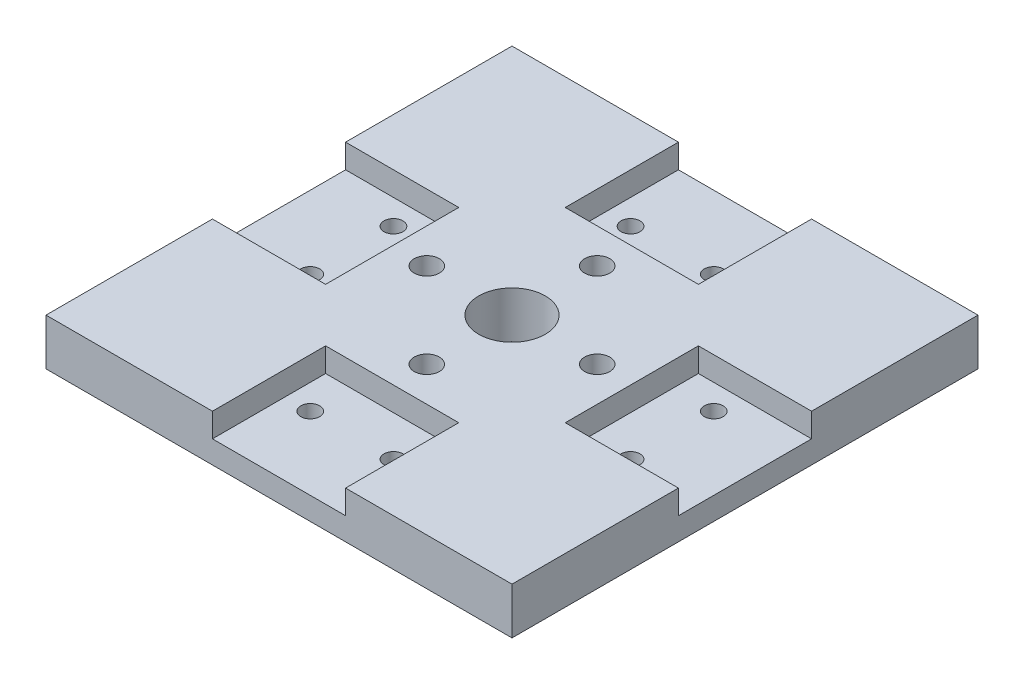
ISO-10303-21;
HEADER;
FILE_DESCRIPTION(('STEP AP214'),'2;1');
FILE_NAME('part.step','',(''),(''),'','','');
FILE_SCHEMA(('AUTOMOTIVE_DESIGN { 1 0 10303 214 1 1 1 1 }'));
ENDSEC;
DATA;
#1=APPLICATION_CONTEXT('core data for automotive mechanical design processes');
#2=APPLICATION_PROTOCOL_DEFINITION('international standard','automotive_design',2000,#1);
#3=PRODUCT_CONTEXT('',#1,'mechanical');
#4=PRODUCT('Part','Part','',(#3));
#5=PRODUCT_RELATED_PRODUCT_CATEGORY('part','',(#4));
#6=PRODUCT_DEFINITION_FORMATION('','',#4);
#7=PRODUCT_DEFINITION_CONTEXT('part definition',#1,'design');
#8=PRODUCT_DEFINITION('design','',#6,#7);
#9=PRODUCT_DEFINITION_SHAPE('','',#8);
#10=(LENGTH_UNIT() NAMED_UNIT(*) SI_UNIT(.MILLI.,.METRE.));
#11=(NAMED_UNIT(*) PLANE_ANGLE_UNIT() SI_UNIT($,.RADIAN.));
#12=(NAMED_UNIT(*) SI_UNIT($,.STERADIAN.) SOLID_ANGLE_UNIT());
#13=UNCERTAINTY_MEASURE_WITH_UNIT(LENGTH_MEASURE(1.E-05),#10,'distance_accuracy_value','');
#14=(GEOMETRIC_REPRESENTATION_CONTEXT(3) GLOBAL_UNCERTAINTY_ASSIGNED_CONTEXT((#13)) GLOBAL_UNIT_ASSIGNED_CONTEXT((#10,
#11,#12)) REPRESENTATION_CONTEXT('',''));
#15=CARTESIAN_POINT('',(0.,0.,0.));
#16=DIRECTION('',(0.,0.,1.));
#17=DIRECTION('',(1.,0.,0.));
#18=AXIS2_PLACEMENT_3D('',#15,#16,#17);
#19=CARTESIAN_POINT('',(0.,8.89,0.));
#20=DIRECTION('',(1.,0.,0.));
#21=DIRECTION('',(0.,0.,-1.));
#22=AXIS2_PLACEMENT_3D('',#19,#20,#21);
#23=PLANE('',#22);
#24=DIRECTION('',(0.,0.,1.));
#25=VECTOR('',#24,1.);
#26=CARTESIAN_POINT('',(0.,4.318,-57.15));
#27=LINE('',#26,#25);
#28=CARTESIAN_POINT('',(0.,4.318,-57.15));
#29=VERTEX_POINT('',#28);
#30=CARTESIAN_POINT('',(0.,4.318,-31.75));
#31=VERTEX_POINT('',#30);
#32=EDGE_CURVE('E232',#29,#31,#27,.T.);
#33=ORIENTED_EDGE('',*,*,#32,.F.);
#34=DIRECTION('',(0.,1.,0.));
#35=VECTOR('',#34,1.);
#36=CARTESIAN_POINT('',(0.,4.318,-57.15));
#37=LINE('',#36,#35);
#38=CARTESIAN_POINT('',(0.,8.89,-57.15));
#39=VERTEX_POINT('',#38);
#40=EDGE_CURVE('E225',#29,#39,#37,.T.);
#41=ORIENTED_EDGE('',*,*,#40,.T.);
#42=DIRECTION('',(0.,0.,1.));
#43=VECTOR('',#42,1.);
#44=CARTESIAN_POINT('',(0.,8.89,0.));
#45=LINE('',#44,#43);
#46=CARTESIAN_POINT('',(0.,8.89,-88.9));
#47=VERTEX_POINT('',#46);
#48=EDGE_CURVE('E303',#47,#39,#45,.T.);
#49=ORIENTED_EDGE('',*,*,#48,.F.);
#50=DIRECTION('',(0.,-1.,0.));
#51=VECTOR('',#50,1.);
#52=CARTESIAN_POINT('',(0.,8.89,-88.9));
#53=LINE('',#52,#51);
#54=CARTESIAN_POINT('',(0.,0.,-88.9));
#55=VERTEX_POINT('',#54);
#56=EDGE_CURVE('E319',#47,#55,#53,.T.);
#57=ORIENTED_EDGE('',*,*,#56,.T.);
#58=DIRECTION('',(0.,0.,1.));
#59=VECTOR('',#58,1.);
#60=CARTESIAN_POINT('',(0.,0.,0.));
#61=LINE('',#60,#59);
#62=CARTESIAN_POINT('',(0.,0.,0.));
#63=VERTEX_POINT('',#62);
#64=EDGE_CURVE('E213',#55,#63,#61,.T.);
#65=ORIENTED_EDGE('',*,*,#64,.T.);
#66=DIRECTION('',(0.,-1.,0.));
#67=VECTOR('',#66,1.);
#68=CARTESIAN_POINT('',(0.,8.89,0.));
#69=LINE('',#68,#67);
#70=CARTESIAN_POINT('',(0.,8.89,0.));
#71=VERTEX_POINT('',#70);
#72=EDGE_CURVE('E11',#71,#63,#69,.T.);
#73=ORIENTED_EDGE('',*,*,#72,.F.);
#74=CARTESIAN_POINT('',(0.,8.89,-31.75));
#75=VERTEX_POINT('',#74);
#76=EDGE_CURVE('E307',#75,#71,#45,.T.);
#77=ORIENTED_EDGE('',*,*,#76,.F.);
#78=DIRECTION('',(0.,1.,0.));
#79=VECTOR('',#78,1.);
#80=CARTESIAN_POINT('',(0.,4.318,-31.75));
#81=LINE('',#80,#79);
#82=EDGE_CURVE('E218',#31,#75,#81,.T.);
#83=ORIENTED_EDGE('',*,*,#82,.F.);
#84=EDGE_LOOP('',(#33,#41,#49,#57,#65,#73,#77,#83));
#85=FACE_BOUND('',#84,.T.);
#86=ADVANCED_FACE('F41',(#85),#23,.F.);
#87=CARTESIAN_POINT('',(0.,8.89,0.));
#88=DIRECTION('',(0.,0.,-1.));
#89=DIRECTION('',(-1.,0.,0.));
#90=AXIS2_PLACEMENT_3D('',#87,#88,#89);
#91=PLANE('',#90);
#92=DIRECTION('',(1.,0.,0.));
#93=VECTOR('',#92,1.);
#94=CARTESIAN_POINT('',(31.75,4.318,0.));
#95=LINE('',#94,#93);
#96=CARTESIAN_POINT('',(31.75,4.318,0.));
#97=VERTEX_POINT('',#96);
#98=CARTESIAN_POINT('',(57.15,4.318,0.));
#99=VERTEX_POINT('',#98);
#100=EDGE_CURVE('E271',#97,#99,#95,.T.);
#101=ORIENTED_EDGE('',*,*,#100,.F.);
#102=DIRECTION('',(0.,1.,0.));
#103=VECTOR('',#102,1.);
#104=CARTESIAN_POINT('',(31.75,4.318,0.));
#105=LINE('',#104,#103);
#106=CARTESIAN_POINT('',(31.75,8.89,0.));
#107=VERTEX_POINT('',#106);
#108=EDGE_CURVE('E247',#97,#107,#105,.T.);
#109=ORIENTED_EDGE('',*,*,#108,.T.);
#110=DIRECTION('',(1.,0.,0.));
#111=VECTOR('',#110,1.);
#112=CARTESIAN_POINT('',(0.,8.89,0.));
#113=LINE('',#112,#111);
#114=EDGE_CURVE('E308',#71,#107,#113,.T.);
#115=ORIENTED_EDGE('',*,*,#114,.F.);
#116=ORIENTED_EDGE('',*,*,#72,.T.);
#117=DIRECTION('',(1.,0.,0.));
#118=VECTOR('',#117,1.);
#119=CARTESIAN_POINT('',(0.,0.,0.));
#120=LINE('',#119,#118);
#121=CARTESIAN_POINT('',(88.9,0.,0.));
#122=VERTEX_POINT('',#121);
#123=EDGE_CURVE('E322',#63,#122,#120,.T.);
#124=ORIENTED_EDGE('',*,*,#123,.T.);
#125=DIRECTION('',(0.,-1.,0.));
#126=VECTOR('',#125,1.);
#127=CARTESIAN_POINT('',(88.9,8.89,0.));
#128=LINE('',#127,#126);
#129=CARTESIAN_POINT('',(88.9,8.89,0.));
#130=VERTEX_POINT('',#129);
#131=EDGE_CURVE('E48',#130,#122,#128,.T.);
#132=ORIENTED_EDGE('',*,*,#131,.F.);
#133=CARTESIAN_POINT('',(57.15,8.89,0.));
#134=VERTEX_POINT('',#133);
#135=EDGE_CURVE('E306',#134,#130,#113,.T.);
#136=ORIENTED_EDGE('',*,*,#135,.F.);
#137=DIRECTION('',(0.,1.,0.));
#138=VECTOR('',#137,1.);
#139=CARTESIAN_POINT('',(57.15,4.318,0.));
#140=LINE('',#139,#138);
#141=EDGE_CURVE('E251',#99,#134,#140,.T.);
#142=ORIENTED_EDGE('',*,*,#141,.F.);
#143=EDGE_LOOP('',(#101,#109,#115,#116,#124,#132,#136,#142));
#144=FACE_BOUND('',#143,.T.);
#145=ADVANCED_FACE('F374',(#144),#91,.F.);
#146=CARTESIAN_POINT('',(88.9,8.89,0.));
#147=DIRECTION('',(-1.,0.,0.));
#148=DIRECTION('',(0.,0.,1.));
#149=AXIS2_PLACEMENT_3D('',#146,#147,#148);
#150=PLANE('',#149);
#151=DIRECTION('',(0.,0.,-1.));
#152=VECTOR('',#151,1.);
#153=CARTESIAN_POINT('',(88.9,4.318,-57.15));
#154=LINE('',#153,#152);
#155=CARTESIAN_POINT('',(88.9,4.318,-31.75));
#156=VERTEX_POINT('',#155);
#157=CARTESIAN_POINT('',(88.9,4.318,-57.15));
#158=VERTEX_POINT('',#157);
#159=EDGE_CURVE('E289',#156,#158,#154,.T.);
#160=ORIENTED_EDGE('',*,*,#159,.F.);
#161=DIRECTION('',(0.,1.,0.));
#162=VECTOR('',#161,1.);
#163=CARTESIAN_POINT('',(88.9,4.318,-31.75));
#164=LINE('',#163,#162);
#165=CARTESIAN_POINT('',(88.9,8.89,-31.75));
#166=VERTEX_POINT('',#165);
#167=EDGE_CURVE('E282',#156,#166,#164,.T.);
#168=ORIENTED_EDGE('',*,*,#167,.T.);
#169=DIRECTION('',(0.,0.,-1.));
#170=VECTOR('',#169,1.);
#171=CARTESIAN_POINT('',(88.9,8.89,0.));
#172=LINE('',#171,#170);
#173=EDGE_CURVE('E312',#130,#166,#172,.T.);
#174=ORIENTED_EDGE('',*,*,#173,.F.);
#175=ORIENTED_EDGE('',*,*,#131,.T.);
#176=DIRECTION('',(0.,0.,-1.));
#177=VECTOR('',#176,1.);
#178=CARTESIAN_POINT('',(88.9,0.,0.));
#179=LINE('',#178,#177);
#180=CARTESIAN_POINT('',(88.9,0.,-88.9));
#181=VERTEX_POINT('',#180);
#182=EDGE_CURVE('E324',#122,#181,#179,.T.);
#183=ORIENTED_EDGE('',*,*,#182,.T.);
#184=DIRECTION('',(0.,-1.,0.));
#185=VECTOR('',#184,1.);
#186=CARTESIAN_POINT('',(88.9,8.89,-88.9));
#187=LINE('',#186,#185);
#188=CARTESIAN_POINT('',(88.9,8.89,-88.9));
#189=VERTEX_POINT('',#188);
#190=EDGE_CURVE('E330',#189,#181,#187,.T.);
#191=ORIENTED_EDGE('',*,*,#190,.F.);
#192=CARTESIAN_POINT('',(88.9,8.89,-57.15));
#193=VERTEX_POINT('',#192);
#194=EDGE_CURVE('E311',#193,#189,#172,.T.);
#195=ORIENTED_EDGE('',*,*,#194,.F.);
#196=DIRECTION('',(0.,1.,0.));
#197=VECTOR('',#196,1.);
#198=CARTESIAN_POINT('',(88.9,4.318,-57.15));
#199=LINE('',#198,#197);
#200=EDGE_CURVE('E63',#158,#193,#199,.T.);
#201=ORIENTED_EDGE('',*,*,#200,.F.);
#202=EDGE_LOOP('',(#160,#168,#174,#175,#183,#191,#195,#201));
#203=FACE_BOUND('',#202,.T.);
#204=ADVANCED_FACE('F338',(#203),#150,.F.);
#205=CARTESIAN_POINT('',(0.,8.89,-88.9));
#206=DIRECTION('',(0.,0.,1.));
#207=DIRECTION('',(1.,0.,0.));
#208=AXIS2_PLACEMENT_3D('',#205,#206,#207);
#209=PLANE('',#208);
#210=DIRECTION('',(-1.,0.,0.));
#211=VECTOR('',#210,1.);
#212=CARTESIAN_POINT('',(0.,8.89,-88.9));
#213=LINE('',#212,#211);
#214=CARTESIAN_POINT('',(31.75,8.89,-88.9));
#215=VERTEX_POINT('',#214);
#216=EDGE_CURVE('E315',#215,#47,#213,.T.);
#217=ORIENTED_EDGE('',*,*,#216,.F.);
#218=DIRECTION('',(0.,1.,0.));
#219=VECTOR('',#218,1.);
#220=CARTESIAN_POINT('',(31.75,4.318,-88.9));
#221=LINE('',#220,#219);
#222=CARTESIAN_POINT('',(31.75,4.318,-88.9));
#223=VERTEX_POINT('',#222);
#224=EDGE_CURVE('E211',#223,#215,#221,.T.);
#225=ORIENTED_EDGE('',*,*,#224,.F.);
#226=DIRECTION('',(-1.,0.,0.));
#227=VECTOR('',#226,1.);
#228=CARTESIAN_POINT('',(31.75,4.318,-88.9));
#229=LINE('',#228,#227);
#230=CARTESIAN_POINT('',(57.15,4.318,-88.9));
#231=VERTEX_POINT('',#230);
#232=EDGE_CURVE('E185',#231,#223,#229,.T.);
#233=ORIENTED_EDGE('',*,*,#232,.F.);
#234=DIRECTION('',(0.,1.,0.));
#235=VECTOR('',#234,1.);
#236=CARTESIAN_POINT('',(57.15,4.318,-88.9));
#237=LINE('',#236,#235);
#238=CARTESIAN_POINT('',(57.15,8.89,-88.9));
#239=VERTEX_POINT('',#238);
#240=EDGE_CURVE('E214',#231,#239,#237,.T.);
#241=ORIENTED_EDGE('',*,*,#240,.T.);
#242=EDGE_CURVE('E316',#189,#239,#213,.T.);
#243=ORIENTED_EDGE('',*,*,#242,.F.);
#244=ORIENTED_EDGE('',*,*,#190,.T.);
#245=DIRECTION('',(-1.,0.,0.));
#246=VECTOR('',#245,1.);
#247=CARTESIAN_POINT('',(0.,0.,-88.9));
#248=LINE('',#247,#246);
#249=EDGE_CURVE('E326',#181,#55,#248,.T.);
#250=ORIENTED_EDGE('',*,*,#249,.T.);
#251=ORIENTED_EDGE('',*,*,#56,.F.);
#252=EDGE_LOOP('',(#217,#225,#233,#241,#243,#244,#250,#251));
#253=FACE_BOUND('',#252,.T.);
#254=ADVANCED_FACE('F349',(#253),#209,.F.);
#255=CARTESIAN_POINT('',(0.,8.89,0.));
#256=DIRECTION('',(0.,-1.,0.));
#257=DIRECTION('',(0.,0.,-1.));
#258=AXIS2_PLACEMENT_3D('',#255,#256,#257);
#259=PLANE('',#258);
#260=CARTESIAN_POINT('',(44.45,8.89,-44.45));
#261=DIRECTION('',(0.,1.,0.));
#262=DIRECTION('',(0.,0.,1.));
#263=AXIS2_PLACEMENT_3D('',#260,#261,#262);
#264=CIRCLE('',#263,6.35);
#265=CARTESIAN_POINT('',(44.45,8.89,-38.1));
#266=VERTEX_POINT('',#265);
#267=EDGE_CURVE('E470',#266,#266,#264,.T.);
#268=ORIENTED_EDGE('',*,*,#267,.F.);
#269=EDGE_LOOP('',(#268));
#270=FACE_BOUND('',#269,.T.);
#271=CARTESIAN_POINT('',(60.706,8.89,-44.45));
#272=DIRECTION('',(0.,1.,0.));
#273=DIRECTION('',(0.,0.,1.));
#274=AXIS2_PLACEMENT_3D('',#271,#272,#273);
#275=CIRCLE('',#274,2.40000002599999);
#276=CARTESIAN_POINT('',(60.706,8.89,-42.049999974));
#277=VERTEX_POINT('',#276);
#278=EDGE_CURVE('E512',#277,#277,#275,.T.);
#279=ORIENTED_EDGE('',*,*,#278,.F.);
#280=EDGE_LOOP('',(#279));
#281=FACE_BOUND('',#280,.T.);
#282=CARTESIAN_POINT('',(44.45,8.89,-60.706));
#283=DIRECTION('',(0.,1.,0.));
#284=DIRECTION('',(0.,0.,1.));
#285=AXIS2_PLACEMENT_3D('',#282,#283,#284);
#286=CIRCLE('',#285,2.400000026);
#287=CARTESIAN_POINT('',(44.45,8.89,-58.305999974));
#288=VERTEX_POINT('',#287);
#289=EDGE_CURVE('E515',#288,#288,#286,.T.);
#290=ORIENTED_EDGE('',*,*,#289,.F.);
#291=EDGE_LOOP('',(#290));
#292=FACE_BOUND('',#291,.T.);
#293=CARTESIAN_POINT('',(28.194,8.89,-44.45));
#294=DIRECTION('',(0.,1.,0.));
#295=DIRECTION('',(0.,0.,1.));
#296=AXIS2_PLACEMENT_3D('',#293,#294,#295);
#297=CIRCLE('',#296,2.400000026);
#298=CARTESIAN_POINT('',(28.194,8.89,-42.049999974));
#299=VERTEX_POINT('',#298);
#300=EDGE_CURVE('E521',#299,#299,#297,.T.);
#301=ORIENTED_EDGE('',*,*,#300,.F.);
#302=EDGE_LOOP('',(#301));
#303=FACE_BOUND('',#302,.T.);
#304=CARTESIAN_POINT('',(44.45,8.89,-28.194));
#305=DIRECTION('',(0.,1.,0.));
#306=DIRECTION('',(0.,0.,1.));
#307=AXIS2_PLACEMENT_3D('',#304,#305,#306);
#308=CIRCLE('',#307,2.40000002600001);
#309=CARTESIAN_POINT('',(44.45,8.89,-25.793999974));
#310=VERTEX_POINT('',#309);
#311=EDGE_CURVE('E526',#310,#310,#308,.T.);
#312=ORIENTED_EDGE('',*,*,#311,.F.);
#313=EDGE_LOOP('',(#312));
#314=FACE_BOUND('',#313,.T.);
#315=DIRECTION('',(1.,0.,0.));
#316=VECTOR('',#315,1.);
#317=CARTESIAN_POINT('',(31.75,8.89,-67.31));
#318=LINE('',#317,#316);
#319=CARTESIAN_POINT('',(31.75,8.89,-67.31));
#320=VERTEX_POINT('',#319);
#321=CARTESIAN_POINT('',(57.15,8.89,-67.31));
#322=VERTEX_POINT('',#321);
#323=EDGE_CURVE('E200',#320,#322,#318,.T.);
#324=ORIENTED_EDGE('',*,*,#323,.F.);
#325=DIRECTION('',(0.,0.,1.));
#326=VECTOR('',#325,1.);
#327=CARTESIAN_POINT('',(31.75,8.89,-88.9));
#328=LINE('',#327,#326);
#329=EDGE_CURVE('E55',#215,#320,#328,.T.);
#330=ORIENTED_EDGE('',*,*,#329,.F.);
#331=ORIENTED_EDGE('',*,*,#216,.T.);
#332=ORIENTED_EDGE('',*,*,#48,.T.);
#333=DIRECTION('',(-1.,0.,0.));
#334=VECTOR('',#333,1.);
#335=CARTESIAN_POINT('',(0.,8.89,-57.15));
#336=LINE('',#335,#334);
#337=CARTESIAN_POINT('',(21.59,8.89,-57.15));
#338=VERTEX_POINT('',#337);
#339=EDGE_CURVE('E229',#338,#39,#336,.T.);
#340=ORIENTED_EDGE('',*,*,#339,.F.);
#341=DIRECTION('',(0.,0.,-1.));
#342=VECTOR('',#341,1.);
#343=CARTESIAN_POINT('',(21.59,8.89,-57.15));
#344=LINE('',#343,#342);
#345=CARTESIAN_POINT('',(21.59,8.89,-31.75));
#346=VERTEX_POINT('',#345);
#347=EDGE_CURVE('E231',#346,#338,#344,.T.);
#348=ORIENTED_EDGE('',*,*,#347,.F.);
#349=DIRECTION('',(1.,0.,0.));
#350=VECTOR('',#349,1.);
#351=CARTESIAN_POINT('',(0.,8.89,-31.75));
#352=LINE('',#351,#350);
#353=EDGE_CURVE('E209',#75,#346,#352,.T.);
#354=ORIENTED_EDGE('',*,*,#353,.F.);
#355=ORIENTED_EDGE('',*,*,#76,.T.);
#356=ORIENTED_EDGE('',*,*,#114,.T.);
#357=DIRECTION('',(0.,0.,1.));
#358=VECTOR('',#357,1.);
#359=CARTESIAN_POINT('',(31.75,8.89,0.));
#360=LINE('',#359,#358);
#361=CARTESIAN_POINT('',(31.75,8.89,-21.59));
#362=VERTEX_POINT('',#361);
#363=EDGE_CURVE('E228',#362,#107,#360,.T.);
#364=ORIENTED_EDGE('',*,*,#363,.F.);
#365=DIRECTION('',(-1.,0.,0.));
#366=VECTOR('',#365,1.);
#367=CARTESIAN_POINT('',(31.75,8.89,-21.59));
#368=LINE('',#367,#366);
#369=CARTESIAN_POINT('',(57.15,8.89,-21.59));
#370=VERTEX_POINT('',#369);
#371=EDGE_CURVE('E258',#370,#362,#368,.T.);
#372=ORIENTED_EDGE('',*,*,#371,.F.);
#373=DIRECTION('',(0.,0.,-1.));
#374=VECTOR('',#373,1.);
#375=CARTESIAN_POINT('',(57.15,8.89,0.));
#376=LINE('',#375,#374);
#377=EDGE_CURVE('E261',#134,#370,#376,.T.);
#378=ORIENTED_EDGE('',*,*,#377,.F.);
#379=ORIENTED_EDGE('',*,*,#135,.T.);
#380=ORIENTED_EDGE('',*,*,#173,.T.);
#381=DIRECTION('',(1.,0.,0.));
#382=VECTOR('',#381,1.);
#383=CARTESIAN_POINT('',(88.9,8.89,-31.75));
#384=LINE('',#383,#382);
#385=CARTESIAN_POINT('',(67.31,8.89,-31.75));
#386=VERTEX_POINT('',#385);
#387=EDGE_CURVE('E286',#386,#166,#384,.T.);
#388=ORIENTED_EDGE('',*,*,#387,.F.);
#389=DIRECTION('',(0.,0.,1.));
#390=VECTOR('',#389,1.);
#391=CARTESIAN_POINT('',(67.31,8.89,-57.15));
#392=LINE('',#391,#390);
#393=CARTESIAN_POINT('',(67.31,8.89,-57.15));
#394=VERTEX_POINT('',#393);
#395=EDGE_CURVE('E288',#394,#386,#392,.T.);
#396=ORIENTED_EDGE('',*,*,#395,.F.);
#397=DIRECTION('',(-1.,0.,0.));
#398=VECTOR('',#397,1.);
#399=CARTESIAN_POINT('',(88.9,8.89,-57.15));
#400=LINE('',#399,#398);
#401=EDGE_CURVE('E257',#193,#394,#400,.T.);
#402=ORIENTED_EDGE('',*,*,#401,.F.);
#403=ORIENTED_EDGE('',*,*,#194,.T.);
#404=ORIENTED_EDGE('',*,*,#242,.T.);
#405=DIRECTION('',(0.,0.,-1.));
#406=VECTOR('',#405,1.);
#407=CARTESIAN_POINT('',(57.15,8.89,-88.9));
#408=LINE('',#407,#406);
#409=EDGE_CURVE('E198',#322,#239,#408,.T.);
#410=ORIENTED_EDGE('',*,*,#409,.F.);
#411=EDGE_LOOP('',(#324,#330,#331,#332,#340,#348,#354,#355,#356,#364,#372,#378,#379,#380,#388,
#396,#402,#403,#404,#410));
#412=FACE_BOUND('',#411,.T.);
#413=ADVANCED_FACE('F357',(#270,#281,#292,#303,#314,#412),#259,.F.);
#414=CARTESIAN_POINT('',(0.,0.,0.));
#415=DIRECTION('',(0.,-1.,0.));
#416=DIRECTION('',(0.,0.,-1.));
#417=AXIS2_PLACEMENT_3D('',#414,#415,#416);
#418=PLANE('',#417);
#419=CARTESIAN_POINT('',(44.45,0.,-44.45));
#420=DIRECTION('',(0.,1.,0.));
#421=DIRECTION('',(0.,0.,1.));
#422=AXIS2_PLACEMENT_3D('',#419,#420,#421);
#423=CIRCLE('',#422,6.35);
#424=CARTESIAN_POINT('',(44.45,0.,-38.1));
#425=VERTEX_POINT('',#424);
#426=EDGE_CURVE('E484',#425,#425,#423,.T.);
#427=ORIENTED_EDGE('',*,*,#426,.T.);
#428=EDGE_LOOP('',(#427));
#429=FACE_BOUND('',#428,.T.);
#430=CARTESIAN_POINT('',(75.0062,0.,-36.5125));
#431=DIRECTION('',(0.,1.,0.));
#432=DIRECTION('',(0.,0.,1.));
#433=AXIS2_PLACEMENT_3D('',#430,#431,#432);
#434=CIRCLE('',#433,1.8034);
#435=CARTESIAN_POINT('',(75.0062,0.,-34.7091));
#436=VERTEX_POINT('',#435);
#437=EDGE_CURVE('E489',#436,#436,#434,.T.);
#438=ORIENTED_EDGE('',*,*,#437,.T.);
#439=EDGE_LOOP('',(#438));
#440=FACE_BOUND('',#439,.T.);
#441=CARTESIAN_POINT('',(52.3875,0.,-75.0062));
#442=DIRECTION('',(0.,1.,0.));
#443=DIRECTION('',(0.,0.,1.));
#444=AXIS2_PLACEMENT_3D('',#441,#442,#443);
#445=CIRCLE('',#444,1.80339999999999);
#446=CARTESIAN_POINT('',(52.3875,0.,-73.2028));
#447=VERTEX_POINT('',#446);
#448=EDGE_CURVE('E495',#447,#447,#445,.T.);
#449=ORIENTED_EDGE('',*,*,#448,.T.);
#450=EDGE_LOOP('',(#449));
#451=FACE_BOUND('',#450,.T.);
#452=CARTESIAN_POINT('',(36.5125,0.,-75.0062));
#453=DIRECTION('',(0.,1.,0.));
#454=DIRECTION('',(0.,0.,1.));
#455=AXIS2_PLACEMENT_3D('',#452,#453,#454);
#456=CIRCLE('',#455,1.80339999999999);
#457=CARTESIAN_POINT('',(36.5125,0.,-73.2028));
#458=VERTEX_POINT('',#457);
#459=EDGE_CURVE('E501',#458,#458,#456,.T.);
#460=ORIENTED_EDGE('',*,*,#459,.T.);
#461=EDGE_LOOP('',(#460));
#462=FACE_BOUND('',#461,.T.);
#463=CARTESIAN_POINT('',(13.8938,0.,-52.3875));
#464=DIRECTION('',(0.,1.,0.));
#465=DIRECTION('',(0.,0.,1.));
#466=AXIS2_PLACEMENT_3D('',#463,#464,#465);
#467=CIRCLE('',#466,1.8034);
#468=CARTESIAN_POINT('',(13.8938,0.,-50.5841));
#469=VERTEX_POINT('',#468);
#470=EDGE_CURVE('E461',#469,#469,#467,.T.);
#471=ORIENTED_EDGE('',*,*,#470,.T.);
#472=EDGE_LOOP('',(#471));
#473=FACE_BOUND('',#472,.T.);
#474=CARTESIAN_POINT('',(13.8938,0.,-36.5125));
#475=DIRECTION('',(0.,1.,0.));
#476=DIRECTION('',(0.,0.,1.));
#477=AXIS2_PLACEMENT_3D('',#474,#475,#476);
#478=CIRCLE('',#477,1.8034);
#479=CARTESIAN_POINT('',(13.8938,0.,-34.7091));
#480=VERTEX_POINT('',#479);
#481=EDGE_CURVE('E462',#480,#480,#478,.T.);
#482=ORIENTED_EDGE('',*,*,#481,.T.);
#483=EDGE_LOOP('',(#482));
#484=FACE_BOUND('',#483,.T.);
#485=CARTESIAN_POINT('',(36.5125,0.,-13.8938));
#486=DIRECTION('',(0.,1.,0.));
#487=DIRECTION('',(0.,0.,1.));
#488=AXIS2_PLACEMENT_3D('',#485,#486,#487);
#489=CIRCLE('',#488,1.8034);
#490=CARTESIAN_POINT('',(36.5125,0.,-12.0904));
#491=VERTEX_POINT('',#490);
#492=EDGE_CURVE('E475',#491,#491,#489,.T.);
#493=ORIENTED_EDGE('',*,*,#492,.T.);
#494=EDGE_LOOP('',(#493));
#495=FACE_BOUND('',#494,.T.);
#496=CARTESIAN_POINT('',(52.3875,0.,-13.8938));
#497=DIRECTION('',(0.,1.,0.));
#498=DIRECTION('',(0.,0.,1.));
#499=AXIS2_PLACEMENT_3D('',#496,#497,#498);
#500=CIRCLE('',#499,1.8034);
#501=CARTESIAN_POINT('',(52.3875,0.,-12.0904));
#502=VERTEX_POINT('',#501);
#503=EDGE_CURVE('E481',#502,#502,#500,.T.);
#504=ORIENTED_EDGE('',*,*,#503,.T.);
#505=EDGE_LOOP('',(#504));
#506=FACE_BOUND('',#505,.T.);
#507=CARTESIAN_POINT('',(75.0062,0.,-52.3875));
#508=DIRECTION('',(0.,1.,0.));
#509=DIRECTION('',(0.,0.,1.));
#510=AXIS2_PLACEMENT_3D('',#507,#508,#509);
#511=CIRCLE('',#510,1.8034);
#512=CARTESIAN_POINT('',(75.0062,0.,-50.5841));
#513=VERTEX_POINT('',#512);
#514=EDGE_CURVE('E505',#513,#513,#511,.T.);
#515=ORIENTED_EDGE('',*,*,#514,.T.);
#516=EDGE_LOOP('',(#515));
#517=FACE_BOUND('',#516,.T.);
#518=CARTESIAN_POINT('',(60.706,0.,-44.45));
#519=DIRECTION('',(0.,1.,0.));
#520=DIRECTION('',(0.,0.,1.));
#521=AXIS2_PLACEMENT_3D('',#518,#519,#520);
#522=CIRCLE('',#521,2.40000002599999);
#523=CARTESIAN_POINT('',(60.706,0.,-42.049999974));
#524=VERTEX_POINT('',#523);
#525=EDGE_CURVE('E285',#524,#524,#522,.T.);
#526=ORIENTED_EDGE('',*,*,#525,.T.);
#527=EDGE_LOOP('',(#526));
#528=FACE_BOUND('',#527,.T.);
#529=CARTESIAN_POINT('',(44.45,0.,-60.706));
#530=DIRECTION('',(0.,1.,0.));
#531=DIRECTION('',(0.,0.,1.));
#532=AXIS2_PLACEMENT_3D('',#529,#530,#531);
#533=CIRCLE('',#532,2.400000026);
#534=CARTESIAN_POINT('',(44.45,0.,-58.305999974));
#535=VERTEX_POINT('',#534);
#536=EDGE_CURVE('E518',#535,#535,#533,.T.);
#537=ORIENTED_EDGE('',*,*,#536,.T.);
#538=EDGE_LOOP('',(#537));
#539=FACE_BOUND('',#538,.T.);
#540=CARTESIAN_POINT('',(28.194,0.,-44.45));
#541=DIRECTION('',(0.,1.,0.));
#542=DIRECTION('',(0.,0.,1.));
#543=AXIS2_PLACEMENT_3D('',#540,#541,#542);
#544=CIRCLE('',#543,2.400000026);
#545=CARTESIAN_POINT('',(28.194,0.,-42.049999974));
#546=VERTEX_POINT('',#545);
#547=EDGE_CURVE('E524',#546,#546,#544,.T.);
#548=ORIENTED_EDGE('',*,*,#547,.T.);
#549=EDGE_LOOP('',(#548));
#550=FACE_BOUND('',#549,.T.);
#551=CARTESIAN_POINT('',(44.45,0.,-28.194));
#552=DIRECTION('',(0.,1.,0.));
#553=DIRECTION('',(0.,0.,1.));
#554=AXIS2_PLACEMENT_3D('',#551,#552,#553);
#555=CIRCLE('',#554,2.40000002600001);
#556=CARTESIAN_POINT('',(44.45,0.,-25.793999974));
#557=VERTEX_POINT('',#556);
#558=EDGE_CURVE('E203',#557,#557,#555,.T.);
#559=ORIENTED_EDGE('',*,*,#558,.T.);
#560=EDGE_LOOP('',(#559));
#561=FACE_BOUND('',#560,.T.);
#562=ORIENTED_EDGE('',*,*,#64,.F.);
#563=ORIENTED_EDGE('',*,*,#249,.F.);
#564=ORIENTED_EDGE('',*,*,#182,.F.);
#565=ORIENTED_EDGE('',*,*,#123,.F.);
#566=EDGE_LOOP('',(#562,#563,#564,#565));
#567=FACE_BOUND('',#566,.T.);
#568=ADVANCED_FACE('F345',(#429,#440,#451,#462,#473,#484,#495,#506,#517,#528,#539,#550,#561,
#567),#418,.T.);
#569=CARTESIAN_POINT('',(88.9,4.318,-31.75));
#570=DIRECTION('',(0.,0.,1.));
#571=DIRECTION('',(1.,0.,0.));
#572=AXIS2_PLACEMENT_3D('',#569,#570,#571);
#573=PLANE('',#572);
#574=ORIENTED_EDGE('',*,*,#387,.T.);
#575=ORIENTED_EDGE('',*,*,#167,.F.);
#576=DIRECTION('',(1.,0.,0.));
#577=VECTOR('',#576,1.);
#578=CARTESIAN_POINT('',(88.9,4.318,-31.75));
#579=LINE('',#578,#577);
#580=CARTESIAN_POINT('',(67.31,4.318,-31.75));
#581=VERTEX_POINT('',#580);
#582=EDGE_CURVE('E277',#581,#156,#579,.T.);
#583=ORIENTED_EDGE('',*,*,#582,.F.);
#584=DIRECTION('',(0.,1.,0.));
#585=VECTOR('',#584,1.);
#586=CARTESIAN_POINT('',(67.31,4.318,-31.75));
#587=LINE('',#586,#585);
#588=EDGE_CURVE('E280',#581,#386,#587,.T.);
#589=ORIENTED_EDGE('',*,*,#588,.T.);
#590=EDGE_LOOP('',(#574,#575,#583,#589));
#591=FACE_BOUND('',#590,.T.);
#592=ADVANCED_FACE('F368',(#591),#573,.F.);
#593=CARTESIAN_POINT('',(67.31,4.318,-57.15));
#594=DIRECTION('',(-1.,0.,0.));
#595=DIRECTION('',(0.,0.,1.));
#596=AXIS2_PLACEMENT_3D('',#593,#594,#595);
#597=PLANE('',#596);
#598=ORIENTED_EDGE('',*,*,#395,.T.);
#599=ORIENTED_EDGE('',*,*,#588,.F.);
#600=DIRECTION('',(0.,0.,1.));
#601=VECTOR('',#600,1.);
#602=CARTESIAN_POINT('',(67.31,4.318,-57.15));
#603=LINE('',#602,#601);
#604=CARTESIAN_POINT('',(67.31,4.318,-57.15));
#605=VERTEX_POINT('',#604);
#606=EDGE_CURVE('E295',#605,#581,#603,.T.);
#607=ORIENTED_EDGE('',*,*,#606,.F.);
#608=DIRECTION('',(0.,1.,0.));
#609=VECTOR('',#608,1.);
#610=CARTESIAN_POINT('',(67.31,4.318,-57.15));
#611=LINE('',#610,#609);
#612=EDGE_CURVE('E278',#605,#394,#611,.T.);
#613=ORIENTED_EDGE('',*,*,#612,.T.);
#614=EDGE_LOOP('',(#598,#599,#607,#613));
#615=FACE_BOUND('',#614,.T.);
#616=ADVANCED_FACE('F429',(#615),#597,.F.);
#617=CARTESIAN_POINT('',(88.9,4.318,-57.15));
#618=DIRECTION('',(0.,0.,-1.));
#619=DIRECTION('',(-1.,0.,0.));
#620=AXIS2_PLACEMENT_3D('',#617,#618,#619);
#621=PLANE('',#620);
#622=ORIENTED_EDGE('',*,*,#401,.T.);
#623=ORIENTED_EDGE('',*,*,#612,.F.);
#624=DIRECTION('',(-1.,0.,0.));
#625=VECTOR('',#624,1.);
#626=CARTESIAN_POINT('',(88.9,4.318,-57.15));
#627=LINE('',#626,#625);
#628=EDGE_CURVE('E298',#158,#605,#627,.T.);
#629=ORIENTED_EDGE('',*,*,#628,.F.);
#630=ORIENTED_EDGE('',*,*,#200,.T.);
#631=EDGE_LOOP('',(#622,#623,#629,#630));
#632=FACE_BOUND('',#631,.T.);
#633=ADVANCED_FACE('F425',(#632),#621,.F.);
#634=CARTESIAN_POINT('',(0.,4.318,0.));
#635=DIRECTION('',(0.,-1.,0.));
#636=DIRECTION('',(0.,0.,-1.));
#637=AXIS2_PLACEMENT_3D('',#634,#635,#636);
#638=PLANE('',#637);
#639=CARTESIAN_POINT('',(75.0062,4.318,-36.5125));
#640=DIRECTION('',(0.,1.,0.));
#641=DIRECTION('',(0.,0.,1.));
#642=AXIS2_PLACEMENT_3D('',#639,#640,#641);
#643=CIRCLE('',#642,1.8034);
#644=CARTESIAN_POINT('',(75.0062,4.318,-34.7091));
#645=VERTEX_POINT('',#644);
#646=EDGE_CURVE('E485',#645,#645,#643,.T.);
#647=ORIENTED_EDGE('',*,*,#646,.F.);
#648=EDGE_LOOP('',(#647));
#649=FACE_BOUND('',#648,.T.);
#650=CARTESIAN_POINT('',(75.0062,4.318,-52.3875));
#651=DIRECTION('',(0.,1.,0.));
#652=DIRECTION('',(0.,0.,1.));
#653=AXIS2_PLACEMENT_3D('',#650,#651,#652);
#654=CIRCLE('',#653,1.8034);
#655=CARTESIAN_POINT('',(75.0062,4.318,-50.5841));
#656=VERTEX_POINT('',#655);
#657=EDGE_CURVE('E488',#656,#656,#654,.T.);
#658=ORIENTED_EDGE('',*,*,#657,.F.);
#659=EDGE_LOOP('',(#658));
#660=FACE_BOUND('',#659,.T.);
#661=ORIENTED_EDGE('',*,*,#159,.T.);
#662=ORIENTED_EDGE('',*,*,#628,.T.);
#663=ORIENTED_EDGE('',*,*,#606,.T.);
#664=ORIENTED_EDGE('',*,*,#582,.T.);
#665=EDGE_LOOP('',(#661,#662,#663,#664));
#666=FACE_BOUND('',#665,.T.);
#667=ADVANCED_FACE('F364',(#649,#660,#666),#638,.F.);
#668=CARTESIAN_POINT('',(31.75,4.318,0.));
#669=DIRECTION('',(-1.,0.,0.));
#670=DIRECTION('',(0.,0.,1.));
#671=AXIS2_PLACEMENT_3D('',#668,#669,#670);
#672=PLANE('',#671);
#673=ORIENTED_EDGE('',*,*,#363,.T.);
#674=ORIENTED_EDGE('',*,*,#108,.F.);
#675=DIRECTION('',(0.,0.,1.));
#676=VECTOR('',#675,1.);
#677=CARTESIAN_POINT('',(31.75,4.318,0.));
#678=LINE('',#677,#676);
#679=CARTESIAN_POINT('',(31.75,4.318,-21.59));
#680=VERTEX_POINT('',#679);
#681=EDGE_CURVE('E262',#680,#97,#678,.T.);
#682=ORIENTED_EDGE('',*,*,#681,.F.);
#683=DIRECTION('',(0.,1.,0.));
#684=VECTOR('',#683,1.);
#685=CARTESIAN_POINT('',(31.75,4.318,-21.59));
#686=LINE('',#685,#684);
#687=EDGE_CURVE('E255',#680,#362,#686,.T.);
#688=ORIENTED_EDGE('',*,*,#687,.T.);
#689=EDGE_LOOP('',(#673,#674,#682,#688));
#690=FACE_BOUND('',#689,.T.);
#691=ADVANCED_FACE('F382',(#690),#672,.F.);
#692=CARTESIAN_POINT('',(31.75,4.318,-21.59));
#693=DIRECTION('',(0.,0.,-1.));
#694=DIRECTION('',(-1.,0.,0.));
#695=AXIS2_PLACEMENT_3D('',#692,#693,#694);
#696=PLANE('',#695);
#697=ORIENTED_EDGE('',*,*,#371,.T.);
#698=ORIENTED_EDGE('',*,*,#687,.F.);
#699=DIRECTION('',(-1.,0.,0.));
#700=VECTOR('',#699,1.);
#701=CARTESIAN_POINT('',(31.75,4.318,-21.59));
#702=LINE('',#701,#700);
#703=CARTESIAN_POINT('',(57.15,4.318,-21.59));
#704=VERTEX_POINT('',#703);
#705=EDGE_CURVE('E250',#704,#680,#702,.T.);
#706=ORIENTED_EDGE('',*,*,#705,.F.);
#707=DIRECTION('',(0.,1.,0.));
#708=VECTOR('',#707,1.);
#709=CARTESIAN_POINT('',(57.15,4.318,-21.59));
#710=LINE('',#709,#708);
#711=EDGE_CURVE('E253',#704,#370,#710,.T.);
#712=ORIENTED_EDGE('',*,*,#711,.T.);
#713=EDGE_LOOP('',(#697,#698,#706,#712));
#714=FACE_BOUND('',#713,.T.);
#715=ADVANCED_FACE('F438',(#714),#696,.F.);
#716=CARTESIAN_POINT('',(57.15,4.318,0.));
#717=DIRECTION('',(1.,0.,0.));
#718=DIRECTION('',(0.,0.,-1.));
#719=AXIS2_PLACEMENT_3D('',#716,#717,#718);
#720=PLANE('',#719);
#721=ORIENTED_EDGE('',*,*,#377,.T.);
#722=ORIENTED_EDGE('',*,*,#711,.F.);
#723=DIRECTION('',(0.,0.,-1.));
#724=VECTOR('',#723,1.);
#725=CARTESIAN_POINT('',(57.15,4.318,0.));
#726=LINE('',#725,#724);
#727=EDGE_CURVE('E268',#99,#704,#726,.T.);
#728=ORIENTED_EDGE('',*,*,#727,.F.);
#729=ORIENTED_EDGE('',*,*,#141,.T.);
#730=EDGE_LOOP('',(#721,#722,#728,#729));
#731=FACE_BOUND('',#730,.T.);
#732=ADVANCED_FACE('F376',(#731),#720,.F.);
#733=CARTESIAN_POINT('',(0.,4.318,0.));
#734=DIRECTION('',(0.,-1.,0.));
#735=DIRECTION('',(0.,0.,-1.));
#736=AXIS2_PLACEMENT_3D('',#733,#734,#735);
#737=PLANE('',#736);
#738=CARTESIAN_POINT('',(36.5125,4.318,-13.8938));
#739=DIRECTION('',(0.,1.,0.));
#740=DIRECTION('',(0.,0.,1.));
#741=AXIS2_PLACEMENT_3D('',#738,#739,#740);
#742=CIRCLE('',#741,1.8034);
#743=CARTESIAN_POINT('',(36.5125,4.318,-12.0904));
#744=VERTEX_POINT('',#743);
#745=EDGE_CURVE('E467',#744,#744,#742,.T.);
#746=ORIENTED_EDGE('',*,*,#745,.F.);
#747=EDGE_LOOP('',(#746));
#748=FACE_BOUND('',#747,.T.);
#749=CARTESIAN_POINT('',(52.3875,4.318,-13.8938));
#750=DIRECTION('',(0.,1.,0.));
#751=DIRECTION('',(0.,0.,1.));
#752=AXIS2_PLACEMENT_3D('',#749,#750,#751);
#753=CIRCLE('',#752,1.8034);
#754=CARTESIAN_POINT('',(52.3875,4.318,-12.0904));
#755=VERTEX_POINT('',#754);
#756=EDGE_CURVE('E478',#755,#755,#753,.T.);
#757=ORIENTED_EDGE('',*,*,#756,.F.);
#758=EDGE_LOOP('',(#757));
#759=FACE_BOUND('',#758,.T.);
#760=ORIENTED_EDGE('',*,*,#681,.T.);
#761=ORIENTED_EDGE('',*,*,#100,.T.);
#762=ORIENTED_EDGE('',*,*,#727,.T.);
#763=ORIENTED_EDGE('',*,*,#705,.T.);
#764=EDGE_LOOP('',(#760,#761,#762,#763));
#765=FACE_BOUND('',#764,.T.);
#766=ADVANCED_FACE('F379',(#748,#759,#765),#737,.F.);
#767=CARTESIAN_POINT('',(0.,4.318,-57.15));
#768=DIRECTION('',(0.,0.,-1.));
#769=DIRECTION('',(-1.,0.,0.));
#770=AXIS2_PLACEMENT_3D('',#767,#768,#769);
#771=PLANE('',#770);
#772=ORIENTED_EDGE('',*,*,#339,.T.);
#773=ORIENTED_EDGE('',*,*,#40,.F.);
#774=DIRECTION('',(-1.,0.,0.));
#775=VECTOR('',#774,1.);
#776=CARTESIAN_POINT('',(0.,4.318,-57.15));
#777=LINE('',#776,#775);
#778=CARTESIAN_POINT('',(21.59,4.318,-57.15));
#779=VERTEX_POINT('',#778);
#780=EDGE_CURVE('E220',#779,#29,#777,.T.);
#781=ORIENTED_EDGE('',*,*,#780,.F.);
#782=DIRECTION('',(0.,1.,0.));
#783=VECTOR('',#782,1.);
#784=CARTESIAN_POINT('',(21.59,4.318,-57.15));
#785=LINE('',#784,#783);
#786=EDGE_CURVE('E223',#779,#338,#785,.T.);
#787=ORIENTED_EDGE('',*,*,#786,.T.);
#788=EDGE_LOOP('',(#772,#773,#781,#787));
#789=FACE_BOUND('',#788,.T.);
#790=ADVANCED_FACE('F395',(#789),#771,.F.);
#791=CARTESIAN_POINT('',(21.59,4.318,-57.15));
#792=DIRECTION('',(1.,0.,0.));
#793=DIRECTION('',(0.,0.,-1.));
#794=AXIS2_PLACEMENT_3D('',#791,#792,#793);
#795=PLANE('',#794);
#796=ORIENTED_EDGE('',*,*,#347,.T.);
#797=ORIENTED_EDGE('',*,*,#786,.F.);
#798=DIRECTION('',(0.,0.,-1.));
#799=VECTOR('',#798,1.);
#800=CARTESIAN_POINT('',(21.59,4.318,-57.15));
#801=LINE('',#800,#799);
#802=CARTESIAN_POINT('',(21.59,4.318,-31.75));
#803=VERTEX_POINT('',#802);
#804=EDGE_CURVE('E239',#803,#779,#801,.T.);
#805=ORIENTED_EDGE('',*,*,#804,.F.);
#806=DIRECTION('',(0.,1.,0.));
#807=VECTOR('',#806,1.);
#808=CARTESIAN_POINT('',(21.59,4.318,-31.75));
#809=LINE('',#808,#807);
#810=EDGE_CURVE('E221',#803,#346,#809,.T.);
#811=ORIENTED_EDGE('',*,*,#810,.T.);
#812=EDGE_LOOP('',(#796,#797,#805,#811));
#813=FACE_BOUND('',#812,.T.);
#814=ADVANCED_FACE('F397',(#813),#795,.F.);
#815=CARTESIAN_POINT('',(0.,4.318,-31.75));
#816=DIRECTION('',(0.,0.,1.));
#817=DIRECTION('',(1.,0.,0.));
#818=AXIS2_PLACEMENT_3D('',#815,#816,#817);
#819=PLANE('',#818);
#820=ORIENTED_EDGE('',*,*,#353,.T.);
#821=ORIENTED_EDGE('',*,*,#810,.F.);
#822=DIRECTION('',(1.,0.,0.));
#823=VECTOR('',#822,1.);
#824=CARTESIAN_POINT('',(0.,4.318,-31.75));
#825=LINE('',#824,#823);
#826=EDGE_CURVE('E242',#31,#803,#825,.T.);
#827=ORIENTED_EDGE('',*,*,#826,.F.);
#828=ORIENTED_EDGE('',*,*,#82,.T.);
#829=EDGE_LOOP('',(#820,#821,#827,#828));
#830=FACE_BOUND('',#829,.T.);
#831=ADVANCED_FACE('F389',(#830),#819,.F.);
#832=CARTESIAN_POINT('',(0.,4.318,0.));
#833=DIRECTION('',(0.,1.,0.));
#834=DIRECTION('',(0.,0.,1.));
#835=AXIS2_PLACEMENT_3D('',#832,#833,#834);
#836=PLANE('',#835);
#837=CARTESIAN_POINT('',(13.8938,4.318,-52.3875));
#838=DIRECTION('',(0.,1.,0.));
#839=DIRECTION('',(0.,0.,1.));
#840=AXIS2_PLACEMENT_3D('',#837,#838,#839);
#841=CIRCLE('',#840,1.8034);
#842=CARTESIAN_POINT('',(13.8938,4.318,-50.5841));
#843=VERTEX_POINT('',#842);
#844=EDGE_CURVE('E456',#843,#843,#841,.T.);
#845=ORIENTED_EDGE('',*,*,#844,.F.);
#846=EDGE_LOOP('',(#845));
#847=FACE_BOUND('',#846,.T.);
#848=CARTESIAN_POINT('',(13.8938,4.318,-36.5125));
#849=DIRECTION('',(0.,1.,0.));
#850=DIRECTION('',(0.,0.,1.));
#851=AXIS2_PLACEMENT_3D('',#848,#849,#850);
#852=CIRCLE('',#851,1.8034);
#853=CARTESIAN_POINT('',(13.8938,4.318,-34.7091));
#854=VERTEX_POINT('',#853);
#855=EDGE_CURVE('E459',#854,#854,#852,.T.);
#856=ORIENTED_EDGE('',*,*,#855,.F.);
#857=EDGE_LOOP('',(#856));
#858=FACE_BOUND('',#857,.T.);
#859=ORIENTED_EDGE('',*,*,#32,.T.);
#860=ORIENTED_EDGE('',*,*,#826,.T.);
#861=ORIENTED_EDGE('',*,*,#804,.T.);
#862=ORIENTED_EDGE('',*,*,#780,.T.);
#863=EDGE_LOOP('',(#859,#860,#861,#862));
#864=FACE_BOUND('',#863,.T.);
#865=ADVANCED_FACE('F392',(#847,#858,#864),#836,.T.);
#866=CARTESIAN_POINT('',(31.75,4.318,-88.9));
#867=DIRECTION('',(-1.,0.,0.));
#868=DIRECTION('',(0.,0.,1.));
#869=AXIS2_PLACEMENT_3D('',#866,#867,#868);
#870=PLANE('',#869);
#871=ORIENTED_EDGE('',*,*,#329,.T.);
#872=DIRECTION('',(0.,1.,0.));
#873=VECTOR('',#872,1.);
#874=CARTESIAN_POINT('',(31.75,4.318,-67.31));
#875=LINE('',#874,#873);
#876=CARTESIAN_POINT('',(31.75,4.318,-67.31));
#877=VERTEX_POINT('',#876);
#878=EDGE_CURVE('E175',#877,#320,#875,.T.);
#879=ORIENTED_EDGE('',*,*,#878,.F.);
#880=DIRECTION('',(0.,0.,1.));
#881=VECTOR('',#880,1.);
#882=CARTESIAN_POINT('',(31.75,4.318,-88.9));
#883=LINE('',#882,#881);
#884=EDGE_CURVE('E179',#223,#877,#883,.T.);
#885=ORIENTED_EDGE('',*,*,#884,.F.);
#886=ORIENTED_EDGE('',*,*,#224,.T.);
#887=EDGE_LOOP('',(#871,#879,#885,#886));
#888=FACE_BOUND('',#887,.T.);
#889=ADVANCED_FACE('F177',(#888),#870,.F.);
#890=CARTESIAN_POINT('',(57.15,4.318,-88.9));
#891=DIRECTION('',(1.,0.,0.));
#892=DIRECTION('',(0.,0.,-1.));
#893=AXIS2_PLACEMENT_3D('',#890,#891,#892);
#894=PLANE('',#893);
#895=ORIENTED_EDGE('',*,*,#409,.T.);
#896=ORIENTED_EDGE('',*,*,#240,.F.);
#897=DIRECTION('',(0.,0.,-1.));
#898=VECTOR('',#897,1.);
#899=CARTESIAN_POINT('',(57.15,4.318,-88.9));
#900=LINE('',#899,#898);
#901=CARTESIAN_POINT('',(57.15,4.318,-67.31));
#902=VERTEX_POINT('',#901);
#903=EDGE_CURVE('E193',#902,#231,#900,.T.);
#904=ORIENTED_EDGE('',*,*,#903,.F.);
#905=DIRECTION('',(0.,1.,0.));
#906=VECTOR('',#905,1.);
#907=CARTESIAN_POINT('',(57.15,4.318,-67.31));
#908=LINE('',#907,#906);
#909=EDGE_CURVE('E184',#902,#322,#908,.T.);
#910=ORIENTED_EDGE('',*,*,#909,.T.);
#911=EDGE_LOOP('',(#895,#896,#904,#910));
#912=FACE_BOUND('',#911,.T.);
#913=ADVANCED_FACE('F451',(#912),#894,.F.);
#914=CARTESIAN_POINT('',(31.75,4.318,-67.31));
#915=DIRECTION('',(0.,0.,1.));
#916=DIRECTION('',(1.,0.,0.));
#917=AXIS2_PLACEMENT_3D('',#914,#915,#916);
#918=PLANE('',#917);
#919=ORIENTED_EDGE('',*,*,#323,.T.);
#920=ORIENTED_EDGE('',*,*,#909,.F.);
#921=DIRECTION('',(1.,0.,0.));
#922=VECTOR('',#921,1.);
#923=CARTESIAN_POINT('',(31.75,4.318,-67.31));
#924=LINE('',#923,#922);
#925=EDGE_CURVE('E188',#877,#902,#924,.T.);
#926=ORIENTED_EDGE('',*,*,#925,.F.);
#927=ORIENTED_EDGE('',*,*,#878,.T.);
#928=EDGE_LOOP('',(#919,#920,#926,#927));
#929=FACE_BOUND('',#928,.T.);
#930=ADVANCED_FACE('F189',(#929),#918,.F.);
#931=CARTESIAN_POINT('',(0.,4.318,0.));
#932=DIRECTION('',(0.,1.,0.));
#933=DIRECTION('',(0.,0.,1.));
#934=AXIS2_PLACEMENT_3D('',#931,#932,#933);
#935=PLANE('',#934);
#936=CARTESIAN_POINT('',(52.3875,4.318,-75.0062));
#937=DIRECTION('',(0.,1.,0.));
#938=DIRECTION('',(0.,0.,1.));
#939=AXIS2_PLACEMENT_3D('',#936,#937,#938);
#940=CIRCLE('',#939,1.80339999999999);
#941=CARTESIAN_POINT('',(52.3875,4.318,-73.2028));
#942=VERTEX_POINT('',#941);
#943=EDGE_CURVE('E492',#942,#942,#940,.T.);
#944=ORIENTED_EDGE('',*,*,#943,.F.);
#945=EDGE_LOOP('',(#944));
#946=FACE_BOUND('',#945,.T.);
#947=CARTESIAN_POINT('',(36.5125,4.318,-75.0062));
#948=DIRECTION('',(0.,1.,0.));
#949=DIRECTION('',(0.,0.,1.));
#950=AXIS2_PLACEMENT_3D('',#947,#948,#949);
#951=CIRCLE('',#950,1.80339999999999);
#952=CARTESIAN_POINT('',(36.5125,4.318,-73.2028));
#953=VERTEX_POINT('',#952);
#954=EDGE_CURVE('E498',#953,#953,#951,.T.);
#955=ORIENTED_EDGE('',*,*,#954,.F.);
#956=EDGE_LOOP('',(#955));
#957=FACE_BOUND('',#956,.T.);
#958=ORIENTED_EDGE('',*,*,#884,.T.);
#959=ORIENTED_EDGE('',*,*,#925,.T.);
#960=ORIENTED_EDGE('',*,*,#903,.T.);
#961=ORIENTED_EDGE('',*,*,#232,.T.);
#962=EDGE_LOOP('',(#958,#959,#960,#961));
#963=FACE_BOUND('',#962,.T.);
#964=ADVANCED_FACE('F195',(#946,#957,#963),#935,.T.);
#965=CARTESIAN_POINT('',(44.45,0.,-28.194));
#966=DIRECTION('',(0.,1.,0.));
#967=DIRECTION('',(0.,0.,1.));
#968=AXIS2_PLACEMENT_3D('',#965,#966,#967);
#969=CYLINDRICAL_SURFACE('',#968,2.40000002600001);
#970=ORIENTED_EDGE('',*,*,#558,.F.);
#971=EDGE_LOOP('',(#970));
#972=FACE_BOUND('',#971,.T.);
#973=ORIENTED_EDGE('',*,*,#311,.T.);
#974=EDGE_LOOP('',(#973));
#975=FACE_BOUND('',#974,.T.);
#976=ADVANCED_FACE('F534',(#972,#975),#969,.F.);
#977=CARTESIAN_POINT('',(28.194,0.,-44.45));
#978=DIRECTION('',(0.,1.,0.));
#979=DIRECTION('',(0.,0.,1.));
#980=AXIS2_PLACEMENT_3D('',#977,#978,#979);
#981=CYLINDRICAL_SURFACE('',#980,2.400000026);
#982=ORIENTED_EDGE('',*,*,#547,.F.);
#983=EDGE_LOOP('',(#982));
#984=FACE_BOUND('',#983,.T.);
#985=ORIENTED_EDGE('',*,*,#300,.T.);
#986=EDGE_LOOP('',(#985));
#987=FACE_BOUND('',#986,.T.);
#988=ADVANCED_FACE('F536',(#984,#987),#981,.F.);
#989=CARTESIAN_POINT('',(44.45,0.,-60.706));
#990=DIRECTION('',(0.,1.,0.));
#991=DIRECTION('',(0.,0.,1.));
#992=AXIS2_PLACEMENT_3D('',#989,#990,#991);
#993=CYLINDRICAL_SURFACE('',#992,2.400000026);
#994=ORIENTED_EDGE('',*,*,#536,.F.);
#995=EDGE_LOOP('',(#994));
#996=FACE_BOUND('',#995,.T.);
#997=ORIENTED_EDGE('',*,*,#289,.T.);
#998=EDGE_LOOP('',(#997));
#999=FACE_BOUND('',#998,.T.);
#1000=ADVANCED_FACE('F542',(#996,#999),#993,.F.);
#1001=CARTESIAN_POINT('',(60.706,0.,-44.45));
#1002=DIRECTION('',(0.,1.,0.));
#1003=DIRECTION('',(0.,0.,1.));
#1004=AXIS2_PLACEMENT_3D('',#1001,#1002,#1003);
#1005=CYLINDRICAL_SURFACE('',#1004,2.40000002599999);
#1006=ORIENTED_EDGE('',*,*,#525,.F.);
#1007=EDGE_LOOP('',(#1006));
#1008=FACE_BOUND('',#1007,.T.);
#1009=ORIENTED_EDGE('',*,*,#278,.T.);
#1010=EDGE_LOOP('',(#1009));
#1011=FACE_BOUND('',#1010,.T.);
#1012=ADVANCED_FACE('F576',(#1008,#1011),#1005,.F.);
#1013=CARTESIAN_POINT('',(36.5125,0.,-75.0062));
#1014=DIRECTION('',(0.,1.,0.));
#1015=DIRECTION('',(0.,0.,1.));
#1016=AXIS2_PLACEMENT_3D('',#1013,#1014,#1015);
#1017=CYLINDRICAL_SURFACE('',#1016,1.80339999999999);
#1018=ORIENTED_EDGE('',*,*,#459,.F.);
#1019=EDGE_LOOP('',(#1018));
#1020=FACE_BOUND('',#1019,.T.);
#1021=ORIENTED_EDGE('',*,*,#954,.T.);
#1022=EDGE_LOOP('',(#1021));
#1023=FACE_BOUND('',#1022,.T.);
#1024=ADVANCED_FACE('F570',(#1020,#1023),#1017,.F.);
#1025=CARTESIAN_POINT('',(52.3875,0.,-75.0062));
#1026=DIRECTION('',(0.,1.,0.));
#1027=DIRECTION('',(0.,0.,1.));
#1028=AXIS2_PLACEMENT_3D('',#1025,#1026,#1027);
#1029=CYLINDRICAL_SURFACE('',#1028,1.80339999999999);
#1030=ORIENTED_EDGE('',*,*,#448,.F.);
#1031=EDGE_LOOP('',(#1030));
#1032=FACE_BOUND('',#1031,.T.);
#1033=ORIENTED_EDGE('',*,*,#943,.T.);
#1034=EDGE_LOOP('',(#1033));
#1035=FACE_BOUND('',#1034,.T.);
#1036=ADVANCED_FACE('F575',(#1032,#1035),#1029,.F.);
#1037=CARTESIAN_POINT('',(13.8938,0.,-36.5125));
#1038=DIRECTION('',(0.,1.,0.));
#1039=DIRECTION('',(0.,0.,1.));
#1040=AXIS2_PLACEMENT_3D('',#1037,#1038,#1039);
#1041=CYLINDRICAL_SURFACE('',#1040,1.8034);
#1042=ORIENTED_EDGE('',*,*,#481,.F.);
#1043=EDGE_LOOP('',(#1042));
#1044=FACE_BOUND('',#1043,.T.);
#1045=ORIENTED_EDGE('',*,*,#855,.T.);
#1046=EDGE_LOOP('',(#1045));
#1047=FACE_BOUND('',#1046,.T.);
#1048=ADVANCED_FACE('F589',(#1044,#1047),#1041,.F.);
#1049=CARTESIAN_POINT('',(13.8938,0.,-52.3875));
#1050=DIRECTION('',(0.,1.,0.));
#1051=DIRECTION('',(0.,0.,1.));
#1052=AXIS2_PLACEMENT_3D('',#1049,#1050,#1051);
#1053=CYLINDRICAL_SURFACE('',#1052,1.8034);
#1054=ORIENTED_EDGE('',*,*,#470,.F.);
#1055=EDGE_LOOP('',(#1054));
#1056=FACE_BOUND('',#1055,.T.);
#1057=ORIENTED_EDGE('',*,*,#844,.T.);
#1058=EDGE_LOOP('',(#1057));
#1059=FACE_BOUND('',#1058,.T.);
#1060=ADVANCED_FACE('F600',(#1056,#1059),#1053,.F.);
#1061=CARTESIAN_POINT('',(52.3875,0.,-13.8938));
#1062=DIRECTION('',(0.,1.,0.));
#1063=DIRECTION('',(0.,0.,1.));
#1064=AXIS2_PLACEMENT_3D('',#1061,#1062,#1063);
#1065=CYLINDRICAL_SURFACE('',#1064,1.8034);
#1066=ORIENTED_EDGE('',*,*,#503,.F.);
#1067=EDGE_LOOP('',(#1066));
#1068=FACE_BOUND('',#1067,.T.);
#1069=ORIENTED_EDGE('',*,*,#756,.T.);
#1070=EDGE_LOOP('',(#1069));
#1071=FACE_BOUND('',#1070,.T.);
#1072=ADVANCED_FACE('F611',(#1068,#1071),#1065,.F.);
#1073=CARTESIAN_POINT('',(36.5125,0.,-13.8938));
#1074=DIRECTION('',(0.,1.,0.));
#1075=DIRECTION('',(0.,0.,1.));
#1076=AXIS2_PLACEMENT_3D('',#1073,#1074,#1075);
#1077=CYLINDRICAL_SURFACE('',#1076,1.8034);
#1078=ORIENTED_EDGE('',*,*,#492,.F.);
#1079=EDGE_LOOP('',(#1078));
#1080=FACE_BOUND('',#1079,.T.);
#1081=ORIENTED_EDGE('',*,*,#745,.T.);
#1082=EDGE_LOOP('',(#1081));
#1083=FACE_BOUND('',#1082,.T.);
#1084=ADVANCED_FACE('F622',(#1080,#1083),#1077,.F.);
#1085=CARTESIAN_POINT('',(75.0062,0.,-52.3875));
#1086=DIRECTION('',(0.,1.,0.));
#1087=DIRECTION('',(0.,0.,1.));
#1088=AXIS2_PLACEMENT_3D('',#1085,#1086,#1087);
#1089=CYLINDRICAL_SURFACE('',#1088,1.8034);
#1090=ORIENTED_EDGE('',*,*,#514,.F.);
#1091=EDGE_LOOP('',(#1090));
#1092=FACE_BOUND('',#1091,.T.);
#1093=ORIENTED_EDGE('',*,*,#657,.T.);
#1094=EDGE_LOOP('',(#1093));
#1095=FACE_BOUND('',#1094,.T.);
#1096=ADVANCED_FACE('F633',(#1092,#1095),#1089,.F.);
#1097=CARTESIAN_POINT('',(75.0062,0.,-36.5125));
#1098=DIRECTION('',(0.,1.,0.));
#1099=DIRECTION('',(0.,0.,1.));
#1100=AXIS2_PLACEMENT_3D('',#1097,#1098,#1099);
#1101=CYLINDRICAL_SURFACE('',#1100,1.8034);
#1102=ORIENTED_EDGE('',*,*,#437,.F.);
#1103=EDGE_LOOP('',(#1102));
#1104=FACE_BOUND('',#1103,.T.);
#1105=ORIENTED_EDGE('',*,*,#646,.T.);
#1106=EDGE_LOOP('',(#1105));
#1107=FACE_BOUND('',#1106,.T.);
#1108=ADVANCED_FACE('F644',(#1104,#1107),#1101,.F.);
#1109=CARTESIAN_POINT('',(44.45,0.,-44.45));
#1110=DIRECTION('',(0.,1.,0.));
#1111=DIRECTION('',(0.,0.,1.));
#1112=AXIS2_PLACEMENT_3D('',#1109,#1110,#1111);
#1113=CYLINDRICAL_SURFACE('',#1112,6.35);
#1114=ORIENTED_EDGE('',*,*,#426,.F.);
#1115=EDGE_LOOP('',(#1114));
#1116=FACE_BOUND('',#1115,.T.);
#1117=ORIENTED_EDGE('',*,*,#267,.T.);
#1118=EDGE_LOOP('',(#1117));
#1119=FACE_BOUND('',#1118,.T.);
#1120=ADVANCED_FACE('F655',(#1116,#1119),#1113,.F.);
#1121=CLOSED_SHELL('',(#86,#145,#204,#254,#413,#568,#592,#616,#633,#667,#691,#715,#732,#766,
#790,#814,#831,#865,#889,#913,#930,#964,#976,#988,#1000,#1012,#1024,#1036,#1048,#1060,#1072,
#1084,#1096,#1108,#1120));
#1122=MANIFOLD_SOLID_BREP('B2',#1121);
#1123=ADVANCED_BREP_SHAPE_REPRESENTATION('',(#18,#1122),#14);
#1124=SHAPE_DEFINITION_REPRESENTATION(#9,#1123);
ENDSEC;
END-ISO-10303-21;
